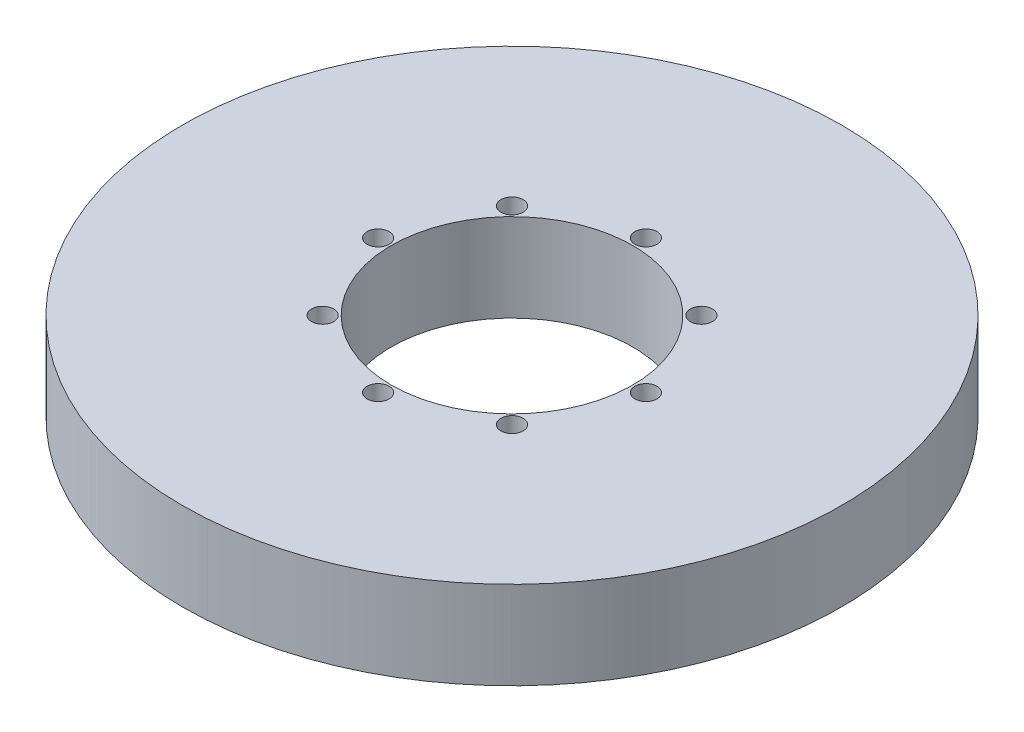
ISO-10303-21;
HEADER;
FILE_DESCRIPTION(('STEP AP214'),'2;1');
FILE_NAME('part.step','',(''),(''),'','','');
FILE_SCHEMA(('AUTOMOTIVE_DESIGN { 1 0 10303 214 1 1 1 1 }'));
ENDSEC;
DATA;
#1=APPLICATION_CONTEXT('core data for automotive mechanical design processes');
#2=APPLICATION_PROTOCOL_DEFINITION('international standard','automotive_design',2000,#1);
#3=PRODUCT_CONTEXT('',#1,'mechanical');
#4=PRODUCT('Part','Part','',(#3));
#5=PRODUCT_RELATED_PRODUCT_CATEGORY('part','',(#4));
#6=PRODUCT_DEFINITION_FORMATION('','',#4);
#7=PRODUCT_DEFINITION_CONTEXT('part definition',#1,'design');
#8=PRODUCT_DEFINITION('design','',#6,#7);
#9=PRODUCT_DEFINITION_SHAPE('','',#8);
#10=(LENGTH_UNIT() NAMED_UNIT(*) SI_UNIT(.MILLI.,.METRE.));
#11=(NAMED_UNIT(*) PLANE_ANGLE_UNIT() SI_UNIT($,.RADIAN.));
#12=(NAMED_UNIT(*) SI_UNIT($,.STERADIAN.) SOLID_ANGLE_UNIT());
#13=UNCERTAINTY_MEASURE_WITH_UNIT(LENGTH_MEASURE(1.E-05),#10,'distance_accuracy_value','');
#14=(GEOMETRIC_REPRESENTATION_CONTEXT(3) GLOBAL_UNCERTAINTY_ASSIGNED_CONTEXT((#13)) GLOBAL_UNIT_ASSIGNED_CONTEXT((#10,
#11,#12)) REPRESENTATION_CONTEXT('',''));
#15=CARTESIAN_POINT('',(0.,0.,0.));
#16=DIRECTION('',(0.,0.,1.));
#17=DIRECTION('',(1.,0.,0.));
#18=AXIS2_PLACEMENT_3D('',#15,#16,#17);
#19=CARTESIAN_POINT('',(0.,20.,0.));
#20=DIRECTION('',(0.,-1.,0.));
#21=DIRECTION('',(0.,0.,-1.));
#22=AXIS2_PLACEMENT_3D('',#19,#20,#21);
#23=CYLINDRICAL_SURFACE('',#22,75.);
#24=CARTESIAN_POINT('',(0.,20.,0.));
#25=DIRECTION('',(0.,1.,0.));
#26=DIRECTION('',(0.,0.,1.));
#27=AXIS2_PLACEMENT_3D('',#24,#25,#26);
#28=CIRCLE('',#27,75.);
#29=CARTESIAN_POINT('',(0.,20.,75.));
#30=VERTEX_POINT('',#29);
#31=EDGE_CURVE('E10',#30,#30,#28,.T.);
#32=ORIENTED_EDGE('',*,*,#31,.F.);
#33=EDGE_LOOP('',(#32));
#34=FACE_BOUND('',#33,.T.);
#35=CARTESIAN_POINT('',(0.,0.,0.));
#36=DIRECTION('',(0.,1.,0.));
#37=DIRECTION('',(0.,0.,1.));
#38=AXIS2_PLACEMENT_3D('',#35,#36,#37);
#39=CIRCLE('',#38,75.);
#40=CARTESIAN_POINT('',(0.,0.,75.));
#41=VERTEX_POINT('',#40);
#42=EDGE_CURVE('E37',#41,#41,#39,.T.);
#43=ORIENTED_EDGE('',*,*,#42,.T.);
#44=EDGE_LOOP('',(#43));
#45=FACE_BOUND('',#44,.T.);
#46=ADVANCED_FACE('F40',(#34,#45),#23,.T.);
#47=CARTESIAN_POINT('',(0.,20.,0.));
#48=DIRECTION('',(0.,1.,0.));
#49=DIRECTION('',(0.,0.,1.));
#50=AXIS2_PLACEMENT_3D('',#47,#48,#49);
#51=PLANE('',#50);
#52=CARTESIAN_POINT('',(1.0640792188104E-13,20.,30.4764400992895));
#53=DIRECTION('',(0.,1.,0.));
#54=DIRECTION('',(1.,0.,0.));
#55=AXIS2_PLACEMENT_3D('',#52,#53,#54);
#56=CIRCLE('',#55,2.51312789751383);
#57=CARTESIAN_POINT('',(2.51312789751393,20.,30.4764400992894));
#58=VERTEX_POINT('',#57);
#59=EDGE_CURVE('E88',#58,#58,#56,.T.);
#60=ORIENTED_EDGE('',*,*,#59,.F.);
#61=EDGE_LOOP('',(#60));
#62=FACE_BOUND('',#61,.T.);
#63=CARTESIAN_POINT('',(21.5500974606333,20.,21.5500974606331));
#64=DIRECTION('',(0.,1.,0.));
#65=DIRECTION('',(0.707106781186544,0.,-0.707106781186551));
#66=AXIS2_PLACEMENT_3D('',#63,#64,#65);
#67=CIRCLE('',#66,2.51312789751383);
#68=CARTESIAN_POINT('',(23.3271472389544,20.,19.7730476823119));
#69=VERTEX_POINT('',#68);
#70=EDGE_CURVE('E79',#69,#69,#67,.T.);
#71=ORIENTED_EDGE('',*,*,#70,.F.);
#72=EDGE_LOOP('',(#71));
#73=FACE_BOUND('',#72,.T.);
#74=CARTESIAN_POINT('',(30.4764400992895,20.,0.));
#75=DIRECTION('',(0.,1.,0.));
#76=DIRECTION('',(0.,0.,-1.));
#77=AXIS2_PLACEMENT_3D('',#74,#75,#76);
#78=CIRCLE('',#77,2.51312789751383);
#79=CARTESIAN_POINT('',(30.4764400992895,20.,-2.51312789751383));
#80=VERTEX_POINT('',#79);
#81=EDGE_CURVE('E74',#80,#80,#78,.T.);
#82=ORIENTED_EDGE('',*,*,#81,.F.);
#83=EDGE_LOOP('',(#82));
#84=FACE_BOUND('',#83,.T.);
#85=CARTESIAN_POINT('',(21.550097460633,20.,-21.5500974606334));
#86=DIRECTION('',(0.,1.,0.));
#87=DIRECTION('',(-0.707106781186554,0.,-0.707106781186541));
#88=AXIS2_PLACEMENT_3D('',#85,#86,#87);
#89=CIRCLE('',#88,2.51312789751383);
#90=CARTESIAN_POINT('',(19.7730476823119,20.,-23.3271472389545));
#91=VERTEX_POINT('',#90);
#92=EDGE_CURVE('E70',#91,#91,#89,.T.);
#93=ORIENTED_EDGE('',*,*,#92,.F.);
#94=EDGE_LOOP('',(#93));
#95=FACE_BOUND('',#94,.T.);
#96=CARTESIAN_POINT('',(-3.19223765643119E-13,20.,-30.4764400992895));
#97=DIRECTION('',(0.,1.,0.));
#98=DIRECTION('',(-1.,0.,0.));
#99=AXIS2_PLACEMENT_3D('',#96,#97,#98);
#100=CIRCLE('',#99,2.51312789751383);
#101=CARTESIAN_POINT('',(-2.51312789751415,20.,-30.4764400992894));
#102=VERTEX_POINT('',#101);
#103=EDGE_CURVE('E100',#102,#102,#100,.T.);
#104=ORIENTED_EDGE('',*,*,#103,.F.);
#105=EDGE_LOOP('',(#104));
#106=FACE_BOUND('',#105,.T.);
#107=CARTESIAN_POINT('',(-21.5500974606335,20.,-21.5500974606329));
#108=DIRECTION('',(0.,1.,0.));
#109=DIRECTION('',(-0.707106781186539,0.,0.707106781186556));
#110=AXIS2_PLACEMENT_3D('',#107,#108,#109);
#111=CIRCLE('',#110,2.51312789751383);
#112=CARTESIAN_POINT('',(-23.3271472389545,20.,-19.7730476823118));
#113=VERTEX_POINT('',#112);
#114=EDGE_CURVE('E93',#113,#113,#111,.T.);
#115=ORIENTED_EDGE('',*,*,#114,.F.);
#116=EDGE_LOOP('',(#115));
#117=FACE_BOUND('',#116,.T.);
#118=CARTESIAN_POINT('',(-21.5500974606332,20.,21.5500974606332));
#119=DIRECTION('',(0.,1.,0.));
#120=DIRECTION('',(0.707106781186549,0.,0.707106781186546));
#121=AXIS2_PLACEMENT_3D('',#118,#119,#120);
#122=CIRCLE('',#121,2.51312789751383);
#123=CARTESIAN_POINT('',(-19.773047682312,20.,23.3271472389543));
#124=VERTEX_POINT('',#123);
#125=EDGE_CURVE('E61',#124,#124,#122,.T.);
#126=ORIENTED_EDGE('',*,*,#125,.F.);
#127=EDGE_LOOP('',(#126));
#128=FACE_BOUND('',#127,.T.);
#129=CARTESIAN_POINT('',(-30.4764400992895,20.,0.));
#130=DIRECTION('',(0.,1.,0.));
#131=DIRECTION('',(0.,0.,1.));
#132=AXIS2_PLACEMENT_3D('',#129,#130,#131);
#133=CIRCLE('',#132,2.51312789751383);
#134=CARTESIAN_POINT('',(-30.4764400992895,20.,2.51312789751383));
#135=VERTEX_POINT('',#134);
#136=EDGE_CURVE('E54',#135,#135,#133,.T.);
#137=ORIENTED_EDGE('',*,*,#136,.F.);
#138=EDGE_LOOP('',(#137));
#139=FACE_BOUND('',#138,.T.);
#140=CARTESIAN_POINT('',(0.,20.,0.));
#141=DIRECTION('',(0.,1.,0.));
#142=DIRECTION('',(0.,0.,1.));
#143=AXIS2_PLACEMENT_3D('',#140,#141,#142);
#144=CIRCLE('',#143,27.5);
#145=CARTESIAN_POINT('',(0.,20.,27.5));
#146=VERTEX_POINT('',#145);
#147=EDGE_CURVE('E50',#146,#146,#144,.T.);
#148=ORIENTED_EDGE('',*,*,#147,.F.);
#149=EDGE_LOOP('',(#148));
#150=FACE_BOUND('',#149,.T.);
#151=ORIENTED_EDGE('',*,*,#31,.T.);
#152=EDGE_LOOP('',(#151));
#153=FACE_BOUND('',#152,.T.);
#154=ADVANCED_FACE('F115',(#62,#73,#84,#95,#106,#117,#128,#139,#150,#153),#51,.T.);
#155=CARTESIAN_POINT('',(0.,0.,0.));
#156=DIRECTION('',(0.,1.,0.));
#157=DIRECTION('',(0.,0.,1.));
#158=AXIS2_PLACEMENT_3D('',#155,#156,#157);
#159=PLANE('',#158);
#160=CARTESIAN_POINT('',(0.,0.,0.));
#161=DIRECTION('',(0.,1.,0.));
#162=DIRECTION('',(0.,0.,1.));
#163=AXIS2_PLACEMENT_3D('',#160,#161,#162);
#164=CIRCLE('',#163,27.5);
#165=CARTESIAN_POINT('',(0.,0.,27.5));
#166=VERTEX_POINT('',#165);
#167=EDGE_CURVE('E47',#166,#166,#164,.T.);
#168=ORIENTED_EDGE('',*,*,#167,.T.);
#169=EDGE_LOOP('',(#168));
#170=FACE_BOUND('',#169,.T.);
#171=ORIENTED_EDGE('',*,*,#42,.F.);
#172=EDGE_LOOP('',(#171));
#173=FACE_BOUND('',#172,.T.);
#174=ADVANCED_FACE('F113',(#170,#173),#159,.F.);
#175=CARTESIAN_POINT('',(0.,20.,0.));
#176=DIRECTION('',(0.,-1.,0.));
#177=DIRECTION('',(0.,0.,-1.));
#178=AXIS2_PLACEMENT_3D('',#175,#176,#177);
#179=CYLINDRICAL_SURFACE('',#178,27.5);
#180=ORIENTED_EDGE('',*,*,#147,.T.);
#181=EDGE_LOOP('',(#180));
#182=FACE_BOUND('',#181,.T.);
#183=ORIENTED_EDGE('',*,*,#167,.F.);
#184=EDGE_LOOP('',(#183));
#185=FACE_BOUND('',#184,.T.);
#186=ADVANCED_FACE('F127',(#182,#185),#179,.F.);
#187=CARTESIAN_POINT('',(-30.4764400992895,0.0628757182365401,0.));
#188=DIRECTION('',(0.,1.,0.));
#189=DIRECTION('',(0.,0.,1.));
#190=AXIS2_PLACEMENT_3D('',#187,#188,#189);
#191=CYLINDRICAL_SURFACE('',#190,2.51312789751383);
#192=CARTESIAN_POINT('',(-30.4764400992895,0.0628757182365401,0.));
#193=DIRECTION('',(0.,1.,0.));
#194=DIRECTION('',(0.,0.,1.));
#195=AXIS2_PLACEMENT_3D('',#192,#193,#194);
#196=CIRCLE('',#195,2.51312789751383);
#197=CARTESIAN_POINT('',(-30.4764400992895,0.0628757182365401,2.51312789751383));
#198=VERTEX_POINT('',#197);
#199=EDGE_CURVE('E55',#198,#198,#196,.T.);
#200=ORIENTED_EDGE('',*,*,#199,.F.);
#201=EDGE_LOOP('',(#200));
#202=FACE_BOUND('',#201,.T.);
#203=ORIENTED_EDGE('',*,*,#136,.T.);
#204=EDGE_LOOP('',(#203));
#205=FACE_BOUND('',#204,.T.);
#206=ADVANCED_FACE('F129',(#202,#205),#191,.F.);
#207=CARTESIAN_POINT('',(-30.4764400992895,0.0628757182365401,0.));
#208=DIRECTION('',(0.,1.,0.));
#209=DIRECTION('',(0.,0.,1.));
#210=AXIS2_PLACEMENT_3D('',#207,#208,#209);
#211=PLANE('',#210);
#212=ORIENTED_EDGE('',*,*,#199,.T.);
#213=EDGE_LOOP('',(#212));
#214=FACE_BOUND('',#213,.T.);
#215=ADVANCED_FACE('F157',(#214),#211,.T.);
#216=CARTESIAN_POINT('',(-21.5500974606332,0.0628757182365401,21.5500974606332));
#217=DIRECTION('',(0.,1.,0.));
#218=DIRECTION('',(0.,0.,1.));
#219=AXIS2_PLACEMENT_3D('',#216,#217,#218);
#220=CYLINDRICAL_SURFACE('',#219,2.51312789751383);
#221=CARTESIAN_POINT('',(-21.5500974606332,0.0628757182365401,21.5500974606332));
#222=DIRECTION('',(0.,1.,0.));
#223=DIRECTION('',(0.707106781186549,0.,0.707106781186546));
#224=AXIS2_PLACEMENT_3D('',#221,#222,#223);
#225=CIRCLE('',#224,2.51312789751383);
#226=CARTESIAN_POINT('',(-19.773047682312,0.0628757182365401,23.3271472389543));
#227=VERTEX_POINT('',#226);
#228=EDGE_CURVE('E59',#227,#227,#225,.T.);
#229=ORIENTED_EDGE('',*,*,#228,.F.);
#230=EDGE_LOOP('',(#229));
#231=FACE_BOUND('',#230,.T.);
#232=ORIENTED_EDGE('',*,*,#125,.T.);
#233=EDGE_LOOP('',(#232));
#234=FACE_BOUND('',#233,.T.);
#235=ADVANCED_FACE('F170',(#231,#234),#220,.F.);
#236=CARTESIAN_POINT('',(-21.5500974606332,0.0628757182365401,21.5500974606332));
#237=DIRECTION('',(0.,1.,0.));
#238=DIRECTION('',(0.707106781186549,0.,0.707106781186546));
#239=AXIS2_PLACEMENT_3D('',#236,#237,#238);
#240=PLANE('',#239);
#241=ORIENTED_EDGE('',*,*,#228,.T.);
#242=EDGE_LOOP('',(#241));
#243=FACE_BOUND('',#242,.T.);
#244=ADVANCED_FACE('F182',(#243),#240,.T.);
#245=CARTESIAN_POINT('',(-21.5500974606335,0.0628757182365401,-21.5500974606329));
#246=DIRECTION('',(0.,1.,0.));
#247=DIRECTION('',(0.,0.,1.));
#248=AXIS2_PLACEMENT_3D('',#245,#246,#247);
#249=CYLINDRICAL_SURFACE('',#248,2.51312789751383);
#250=CARTESIAN_POINT('',(-21.5500974606335,0.0628757182365401,-21.5500974606329));
#251=DIRECTION('',(0.,1.,0.));
#252=DIRECTION('',(-0.707106781186539,0.,0.707106781186556));
#253=AXIS2_PLACEMENT_3D('',#250,#251,#252);
#254=CIRCLE('',#253,2.51312789751383);
#255=CARTESIAN_POINT('',(-23.3271472389545,0.0628757182365401,-19.7730476823118));
#256=VERTEX_POINT('',#255);
#257=EDGE_CURVE('E94',#256,#256,#254,.T.);
#258=ORIENTED_EDGE('',*,*,#257,.F.);
#259=EDGE_LOOP('',(#258));
#260=FACE_BOUND('',#259,.T.);
#261=ORIENTED_EDGE('',*,*,#114,.T.);
#262=EDGE_LOOP('',(#261));
#263=FACE_BOUND('',#262,.T.);
#264=ADVANCED_FACE('F189',(#260,#263),#249,.F.);
#265=CARTESIAN_POINT('',(-21.5500974606335,0.0628757182365401,-21.5500974606329));
#266=DIRECTION('',(0.,1.,0.));
#267=DIRECTION('',(-0.707106781186539,0.,0.707106781186556));
#268=AXIS2_PLACEMENT_3D('',#265,#266,#267);
#269=PLANE('',#268);
#270=ORIENTED_EDGE('',*,*,#257,.T.);
#271=EDGE_LOOP('',(#270));
#272=FACE_BOUND('',#271,.T.);
#273=ADVANCED_FACE('F107',(#272),#269,.T.);
#274=CARTESIAN_POINT('',(-3.19223765643119E-13,0.0628757182365401,-30.4764400992895));
#275=DIRECTION('',(0.,1.,0.));
#276=DIRECTION('',(0.,0.,1.));
#277=AXIS2_PLACEMENT_3D('',#274,#275,#276);
#278=CYLINDRICAL_SURFACE('',#277,2.51312789751383);
#279=CARTESIAN_POINT('',(-3.19223765643119E-13,0.0628757182365401,-30.4764400992895));
#280=DIRECTION('',(0.,1.,0.));
#281=DIRECTION('',(-1.,0.,0.));
#282=AXIS2_PLACEMENT_3D('',#279,#280,#281);
#283=CIRCLE('',#282,2.51312789751383);
#284=CARTESIAN_POINT('',(-2.51312789751415,0.0628757182365401,-30.4764400992894));
#285=VERTEX_POINT('',#284);
#286=EDGE_CURVE('E72',#285,#285,#283,.T.);
#287=ORIENTED_EDGE('',*,*,#286,.F.);
#288=EDGE_LOOP('',(#287));
#289=FACE_BOUND('',#288,.T.);
#290=ORIENTED_EDGE('',*,*,#103,.T.);
#291=EDGE_LOOP('',(#290));
#292=FACE_BOUND('',#291,.T.);
#293=ADVANCED_FACE('F104',(#289,#292),#278,.F.);
#294=CARTESIAN_POINT('',(-3.19223765643119E-13,0.0628757182365401,-30.4764400992895));
#295=DIRECTION('',(0.,1.,0.));
#296=DIRECTION('',(-1.,0.,0.));
#297=AXIS2_PLACEMENT_3D('',#294,#295,#296);
#298=PLANE('',#297);
#299=ORIENTED_EDGE('',*,*,#286,.T.);
#300=EDGE_LOOP('',(#299));
#301=FACE_BOUND('',#300,.T.);
#302=ADVANCED_FACE('F103',(#301),#298,.T.);
#303=CARTESIAN_POINT('',(21.550097460633,0.0628757182365401,-21.5500974606334));
#304=DIRECTION('',(0.,1.,0.));
#305=DIRECTION('',(0.,0.,1.));
#306=AXIS2_PLACEMENT_3D('',#303,#304,#305);
#307=CYLINDRICAL_SURFACE('',#306,2.51312789751383);
#308=CARTESIAN_POINT('',(21.550097460633,0.0628757182365401,-21.5500974606334));
#309=DIRECTION('',(0.,1.,0.));
#310=DIRECTION('',(-0.707106781186554,0.,-0.707106781186541));
#311=AXIS2_PLACEMENT_3D('',#308,#309,#310);
#312=CIRCLE('',#311,2.51312789751383);
#313=CARTESIAN_POINT('',(19.7730476823119,0.0628757182365401,-23.3271472389545));
#314=VERTEX_POINT('',#313);
#315=EDGE_CURVE('E69',#314,#314,#312,.T.);
#316=ORIENTED_EDGE('',*,*,#315,.F.);
#317=EDGE_LOOP('',(#316));
#318=FACE_BOUND('',#317,.T.);
#319=ORIENTED_EDGE('',*,*,#92,.T.);
#320=EDGE_LOOP('',(#319));
#321=FACE_BOUND('',#320,.T.);
#322=ADVANCED_FACE('F219',(#318,#321),#307,.F.);
#323=CARTESIAN_POINT('',(21.550097460633,0.0628757182365401,-21.5500974606334));
#324=DIRECTION('',(0.,1.,0.));
#325=DIRECTION('',(-0.707106781186554,0.,-0.707106781186541));
#326=AXIS2_PLACEMENT_3D('',#323,#324,#325);
#327=PLANE('',#326);
#328=ORIENTED_EDGE('',*,*,#315,.T.);
#329=EDGE_LOOP('',(#328));
#330=FACE_BOUND('',#329,.T.);
#331=ADVANCED_FACE('F227',(#330),#327,.T.);
#332=CARTESIAN_POINT('',(30.4764400992895,0.0628757182365401,0.));
#333=DIRECTION('',(0.,1.,0.));
#334=DIRECTION('',(0.,0.,1.));
#335=AXIS2_PLACEMENT_3D('',#332,#333,#334);
#336=CYLINDRICAL_SURFACE('',#335,2.51312789751383);
#337=CARTESIAN_POINT('',(30.4764400992895,0.0628757182365401,0.));
#338=DIRECTION('',(0.,1.,0.));
#339=DIRECTION('',(0.,0.,-1.));
#340=AXIS2_PLACEMENT_3D('',#337,#338,#339);
#341=CIRCLE('',#340,2.51312789751383);
#342=CARTESIAN_POINT('',(30.4764400992895,0.0628757182365401,-2.51312789751383));
#343=VERTEX_POINT('',#342);
#344=EDGE_CURVE('E80',#343,#343,#341,.T.);
#345=ORIENTED_EDGE('',*,*,#344,.F.);
#346=EDGE_LOOP('',(#345));
#347=FACE_BOUND('',#346,.T.);
#348=ORIENTED_EDGE('',*,*,#81,.T.);
#349=EDGE_LOOP('',(#348));
#350=FACE_BOUND('',#349,.T.);
#351=ADVANCED_FACE('F240',(#347,#350),#336,.F.);
#352=CARTESIAN_POINT('',(30.4764400992895,0.0628757182365401,0.));
#353=DIRECTION('',(0.,1.,0.));
#354=DIRECTION('',(0.,0.,-1.));
#355=AXIS2_PLACEMENT_3D('',#352,#353,#354);
#356=PLANE('',#355);
#357=ORIENTED_EDGE('',*,*,#344,.T.);
#358=EDGE_LOOP('',(#357));
#359=FACE_BOUND('',#358,.T.);
#360=ADVANCED_FACE('F246',(#359),#356,.T.);
#361=CARTESIAN_POINT('',(21.5500974606333,0.0628757182365401,21.5500974606331));
#362=DIRECTION('',(0.,1.,0.));
#363=DIRECTION('',(0.,0.,1.));
#364=AXIS2_PLACEMENT_3D('',#361,#362,#363);
#365=CYLINDRICAL_SURFACE('',#364,2.51312789751383);
#366=CARTESIAN_POINT('',(21.5500974606333,0.0628757182365401,21.5500974606331));
#367=DIRECTION('',(0.,1.,0.));
#368=DIRECTION('',(0.707106781186544,0.,-0.707106781186551));
#369=AXIS2_PLACEMENT_3D('',#366,#367,#368);
#370=CIRCLE('',#369,2.51312789751383);
#371=CARTESIAN_POINT('',(23.3271472389544,0.0628757182365401,19.7730476823119));
#372=VERTEX_POINT('',#371);
#373=EDGE_CURVE('E82',#372,#372,#370,.T.);
#374=ORIENTED_EDGE('',*,*,#373,.F.);
#375=EDGE_LOOP('',(#374));
#376=FACE_BOUND('',#375,.T.);
#377=ORIENTED_EDGE('',*,*,#70,.T.);
#378=EDGE_LOOP('',(#377));
#379=FACE_BOUND('',#378,.T.);
#380=ADVANCED_FACE('F254',(#376,#379),#365,.F.);
#381=CARTESIAN_POINT('',(21.5500974606333,0.0628757182365401,21.5500974606331));
#382=DIRECTION('',(0.,1.,0.));
#383=DIRECTION('',(0.707106781186544,0.,-0.707106781186551));
#384=AXIS2_PLACEMENT_3D('',#381,#382,#383);
#385=PLANE('',#384);
#386=ORIENTED_EDGE('',*,*,#373,.T.);
#387=EDGE_LOOP('',(#386));
#388=FACE_BOUND('',#387,.T.);
#389=ADVANCED_FACE('F262',(#388),#385,.T.);
#390=CARTESIAN_POINT('',(1.0640792188104E-13,0.0628757182365401,30.4764400992895));
#391=DIRECTION('',(0.,1.,0.));
#392=DIRECTION('',(0.,0.,1.));
#393=AXIS2_PLACEMENT_3D('',#390,#391,#392);
#394=CYLINDRICAL_SURFACE('',#393,2.51312789751383);
#395=CARTESIAN_POINT('',(1.0640792188104E-13,0.0628757182365401,30.4764400992895));
#396=DIRECTION('',(0.,1.,0.));
#397=DIRECTION('',(1.,0.,0.));
#398=AXIS2_PLACEMENT_3D('',#395,#396,#397);
#399=CIRCLE('',#398,2.51312789751383);
#400=CARTESIAN_POINT('',(2.51312789751393,0.0628757182365401,30.4764400992894));
#401=VERTEX_POINT('',#400);
#402=EDGE_CURVE('E63',#401,#401,#399,.T.);
#403=ORIENTED_EDGE('',*,*,#402,.F.);
#404=EDGE_LOOP('',(#403));
#405=FACE_BOUND('',#404,.T.);
#406=ORIENTED_EDGE('',*,*,#59,.T.);
#407=EDGE_LOOP('',(#406));
#408=FACE_BOUND('',#407,.T.);
#409=ADVANCED_FACE('F272',(#405,#408),#394,.F.);
#410=CARTESIAN_POINT('',(1.0640792188104E-13,0.0628757182365401,30.4764400992895));
#411=DIRECTION('',(0.,1.,0.));
#412=DIRECTION('',(1.,0.,0.));
#413=AXIS2_PLACEMENT_3D('',#410,#411,#412);
#414=PLANE('',#413);
#415=ORIENTED_EDGE('',*,*,#402,.T.);
#416=EDGE_LOOP('',(#415));
#417=FACE_BOUND('',#416,.T.);
#418=ADVANCED_FACE('F285',(#417),#414,.T.);
#419=CLOSED_SHELL('',(#46,#154,#174,#186,#206,#215,#235,#244,#264,#273,#293,#302,#322,#331,#351,
#360,#380,#389,#409,#418));
#420=MANIFOLD_SOLID_BREP('B2',#419);
#421=ADVANCED_BREP_SHAPE_REPRESENTATION('',(#18,#420),#14);
#422=SHAPE_DEFINITION_REPRESENTATION(#9,#421);
ENDSEC;
END-ISO-10303-21;
